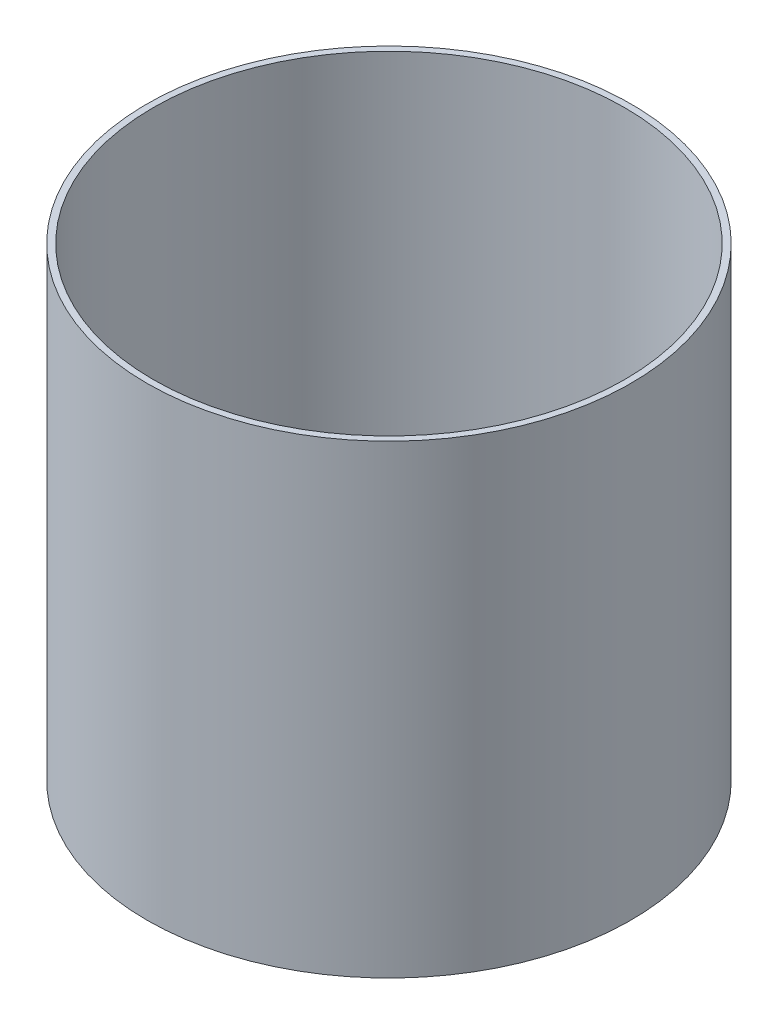
ISO-10303-21;
HEADER;
FILE_DESCRIPTION(('STEP AP214'),'2;1');
FILE_NAME('part.step','',(''),(''),'','','');
FILE_SCHEMA(('AUTOMOTIVE_DESIGN { 1 0 10303 214 1 1 1 1 }'));
ENDSEC;
DATA;
#1=APPLICATION_CONTEXT('core data for automotive mechanical design processes');
#2=APPLICATION_PROTOCOL_DEFINITION('international standard','automotive_design',2000,#1);
#3=PRODUCT_CONTEXT('',#1,'mechanical');
#4=PRODUCT('Part','Part','',(#3));
#5=PRODUCT_RELATED_PRODUCT_CATEGORY('part','',(#4));
#6=PRODUCT_DEFINITION_FORMATION('','',#4);
#7=PRODUCT_DEFINITION_CONTEXT('part definition',#1,'design');
#8=PRODUCT_DEFINITION('design','',#6,#7);
#9=PRODUCT_DEFINITION_SHAPE('','',#8);
#10=(LENGTH_UNIT() NAMED_UNIT(*) SI_UNIT(.MILLI.,.METRE.));
#11=(NAMED_UNIT(*) PLANE_ANGLE_UNIT() SI_UNIT($,.RADIAN.));
#12=(NAMED_UNIT(*) SI_UNIT($,.STERADIAN.) SOLID_ANGLE_UNIT());
#13=UNCERTAINTY_MEASURE_WITH_UNIT(LENGTH_MEASURE(1.E-05),#10,'distance_accuracy_value','');
#14=(GEOMETRIC_REPRESENTATION_CONTEXT(3) GLOBAL_UNCERTAINTY_ASSIGNED_CONTEXT((#13)) GLOBAL_UNIT_ASSIGNED_CONTEXT((#10,
#11,#12)) REPRESENTATION_CONTEXT('',''));
#15=CARTESIAN_POINT('',(0.,0.,0.));
#16=DIRECTION('',(0.,0.,1.));
#17=DIRECTION('',(1.,0.,0.));
#18=AXIS2_PLACEMENT_3D('',#15,#16,#17);
#19=CARTESIAN_POINT('',(0.,36.5,0.));
#20=DIRECTION('',(0.,1.,0.));
#21=DIRECTION('',(0.,0.,1.));
#22=AXIS2_PLACEMENT_3D('',#19,#20,#21);
#23=PLANE('',#22);
#24=CARTESIAN_POINT('',(0.,36.5,0.));
#25=DIRECTION('',(0.,1.,0.));
#26=DIRECTION('',(0.,0.,1.));
#27=AXIS2_PLACEMENT_3D('',#24,#25,#26);
#28=CIRCLE('',#27,19.);
#29=CARTESIAN_POINT('',(0.,36.5,19.));
#30=VERTEX_POINT('',#29);
#31=EDGE_CURVE('E10',#30,#30,#28,.T.);
#32=ORIENTED_EDGE('',*,*,#31,.T.);
#33=EDGE_LOOP('',(#32));
#34=FACE_BOUND('',#33,.T.);
#35=CARTESIAN_POINT('',(0.,36.5,0.));
#36=DIRECTION('',(0.,1.,0.));
#37=DIRECTION('',(0.,0.,1.));
#38=AXIS2_PLACEMENT_3D('',#35,#36,#37);
#39=CIRCLE('',#38,18.5);
#40=CARTESIAN_POINT('',(0.,36.5,18.5));
#41=VERTEX_POINT('',#40);
#42=EDGE_CURVE('E56',#41,#41,#39,.T.);
#43=ORIENTED_EDGE('',*,*,#42,.F.);
#44=EDGE_LOOP('',(#43));
#45=FACE_BOUND('',#44,.T.);
#46=ADVANCED_FACE('F41',(#34,#45),#23,.T.);
#47=CARTESIAN_POINT('',(0.,0.,0.));
#48=DIRECTION('',(0.,1.,0.));
#49=DIRECTION('',(0.,0.,1.));
#50=AXIS2_PLACEMENT_3D('',#47,#48,#49);
#51=PLANE('',#50);
#52=CARTESIAN_POINT('',(0.,0.,0.));
#53=DIRECTION('',(0.,1.,0.));
#54=DIRECTION('',(0.,0.,1.));
#55=AXIS2_PLACEMENT_3D('',#52,#53,#54);
#56=CIRCLE('',#55,19.);
#57=CARTESIAN_POINT('',(0.,0.,19.));
#58=VERTEX_POINT('',#57);
#59=EDGE_CURVE('E45',#58,#58,#56,.T.);
#60=ORIENTED_EDGE('',*,*,#59,.F.);
#61=EDGE_LOOP('',(#60));
#62=FACE_BOUND('',#61,.T.);
#63=CARTESIAN_POINT('',(0.,0.,0.));
#64=DIRECTION('',(0.,1.,0.));
#65=DIRECTION('',(0.,0.,1.));
#66=AXIS2_PLACEMENT_3D('',#63,#64,#65);
#67=CIRCLE('',#66,18.5);
#68=CARTESIAN_POINT('',(0.,0.,18.5));
#69=VERTEX_POINT('',#68);
#70=EDGE_CURVE('E58',#69,#69,#67,.T.);
#71=ORIENTED_EDGE('',*,*,#70,.T.);
#72=EDGE_LOOP('',(#71));
#73=FACE_BOUND('',#72,.T.);
#74=ADVANCED_FACE('F70',(#62,#73),#51,.F.);
#75=CARTESIAN_POINT('',(0.,36.5,0.));
#76=DIRECTION('',(0.,-1.,0.));
#77=DIRECTION('',(0.,0.,-1.));
#78=AXIS2_PLACEMENT_3D('',#75,#76,#77);
#79=CYLINDRICAL_SURFACE('',#78,19.);
#80=ORIENTED_EDGE('',*,*,#31,.F.);
#81=EDGE_LOOP('',(#80));
#82=FACE_BOUND('',#81,.T.);
#83=ORIENTED_EDGE('',*,*,#59,.T.);
#84=EDGE_LOOP('',(#83));
#85=FACE_BOUND('',#84,.T.);
#86=ADVANCED_FACE('F43',(#82,#85),#79,.T.);
#87=CARTESIAN_POINT('',(0.,36.5,0.));
#88=DIRECTION('',(0.,-1.,0.));
#89=DIRECTION('',(0.,0.,-1.));
#90=AXIS2_PLACEMENT_3D('',#87,#88,#89);
#91=CYLINDRICAL_SURFACE('',#90,18.5);
#92=ORIENTED_EDGE('',*,*,#42,.T.);
#93=EDGE_LOOP('',(#92));
#94=FACE_BOUND('',#93,.T.);
#95=ORIENTED_EDGE('',*,*,#70,.F.);
#96=EDGE_LOOP('',(#95));
#97=FACE_BOUND('',#96,.T.);
#98=ADVANCED_FACE('F66',(#94,#97),#91,.F.);
#99=CLOSED_SHELL('',(#46,#74,#86,#98));
#100=MANIFOLD_SOLID_BREP('B2',#99);
#101=ADVANCED_BREP_SHAPE_REPRESENTATION('',(#18,#100),#14);
#102=SHAPE_DEFINITION_REPRESENTATION(#9,#101);
ENDSEC;
END-ISO-10303-21;
